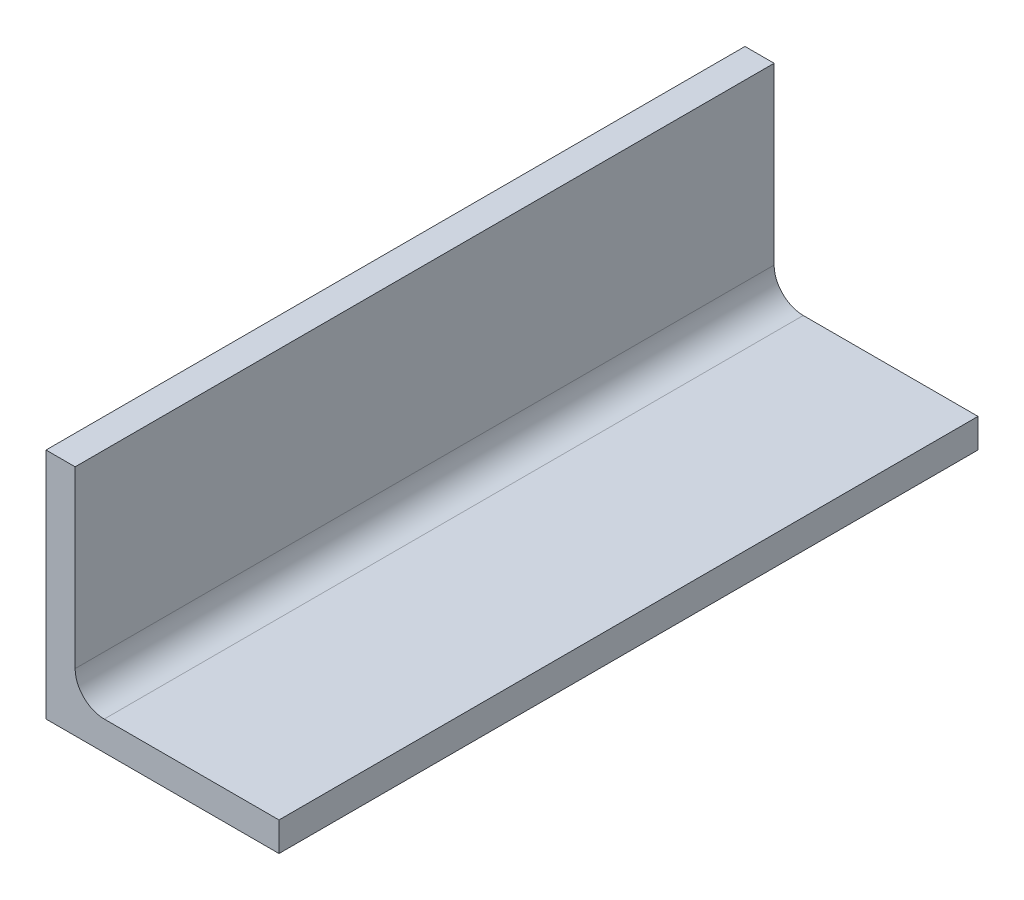
ISO-10303-21;
HEADER;
FILE_DESCRIPTION(('STEP AP214'),'2;1');
FILE_NAME('part.step','',(''),(''),'','','');
FILE_SCHEMA(('AUTOMOTIVE_DESIGN { 1 0 10303 214 1 1 1 1 }'));
ENDSEC;
DATA;
#1=APPLICATION_CONTEXT('core data for automotive mechanical design processes');
#2=APPLICATION_PROTOCOL_DEFINITION('international standard','automotive_design',2000,#1);
#3=PRODUCT_CONTEXT('',#1,'mechanical');
#4=PRODUCT('Part','Part','',(#3));
#5=PRODUCT_RELATED_PRODUCT_CATEGORY('part','',(#4));
#6=PRODUCT_DEFINITION_FORMATION('','',#4);
#7=PRODUCT_DEFINITION_CONTEXT('part definition',#1,'design');
#8=PRODUCT_DEFINITION('design','',#6,#7);
#9=PRODUCT_DEFINITION_SHAPE('','',#8);
#10=(LENGTH_UNIT() NAMED_UNIT(*) SI_UNIT(.MILLI.,.METRE.));
#11=(NAMED_UNIT(*) PLANE_ANGLE_UNIT() SI_UNIT($,.RADIAN.));
#12=(NAMED_UNIT(*) SI_UNIT($,.STERADIAN.) SOLID_ANGLE_UNIT());
#13=UNCERTAINTY_MEASURE_WITH_UNIT(LENGTH_MEASURE(1.E-05),#10,'distance_accuracy_value','');
#14=(GEOMETRIC_REPRESENTATION_CONTEXT(3) GLOBAL_UNCERTAINTY_ASSIGNED_CONTEXT((#13)) GLOBAL_UNIT_ASSIGNED_CONTEXT((#10,
#11,#12)) REPRESENTATION_CONTEXT('',''));
#15=CARTESIAN_POINT('',(0.,0.,0.));
#16=DIRECTION('',(0.,0.,1.));
#17=DIRECTION('',(1.,0.,0.));
#18=AXIS2_PLACEMENT_3D('',#15,#16,#17);
#19=CARTESIAN_POINT('',(50.8,0.,76.2));
#20=DIRECTION('',(0.,1.,0.));
#21=DIRECTION('',(-1.,0.,0.));
#22=AXIS2_PLACEMENT_3D('',#19,#20,#21);
#23=PLANE('',#22);
#24=DIRECTION('',(1.,0.,0.));
#25=VECTOR('',#24,1.);
#26=CARTESIAN_POINT('',(50.8,0.,-76.2));
#27=LINE('',#26,#25);
#28=CARTESIAN_POINT('',(0.,0.,-76.2));
#29=VERTEX_POINT('',#28);
#30=CARTESIAN_POINT('',(50.8,0.,-76.2));
#31=VERTEX_POINT('',#30);
#32=EDGE_CURVE('E107',#29,#31,#27,.T.);
#33=ORIENTED_EDGE('',*,*,#32,.T.);
#34=DIRECTION('',(0.,0.,-1.));
#35=VECTOR('',#34,1.);
#36=CARTESIAN_POINT('',(50.8,0.,76.2));
#37=LINE('',#36,#35);
#38=CARTESIAN_POINT('',(50.8,0.,76.2));
#39=VERTEX_POINT('',#38);
#40=EDGE_CURVE('E11',#39,#31,#37,.T.);
#41=ORIENTED_EDGE('',*,*,#40,.F.);
#42=DIRECTION('',(1.,0.,0.));
#43=VECTOR('',#42,1.);
#44=CARTESIAN_POINT('',(50.8,0.,76.2));
#45=LINE('',#44,#43);
#46=CARTESIAN_POINT('',(0.,0.,76.2));
#47=VERTEX_POINT('',#46);
#48=EDGE_CURVE('E119',#47,#39,#45,.T.);
#49=ORIENTED_EDGE('',*,*,#48,.F.);
#50=DIRECTION('',(0.,0.,-1.));
#51=VECTOR('',#50,1.);
#52=CARTESIAN_POINT('',(0.,0.,76.2));
#53=LINE('',#52,#51);
#54=EDGE_CURVE('E103',#47,#29,#53,.T.);
#55=ORIENTED_EDGE('',*,*,#54,.T.);
#56=EDGE_LOOP('',(#33,#41,#49,#55));
#57=FACE_BOUND('',#56,.T.);
#58=ADVANCED_FACE('F17',(#57),#23,.F.);
#59=CARTESIAN_POINT('',(50.8,6.35,76.2));
#60=DIRECTION('',(-1.,0.,0.));
#61=DIRECTION('',(0.,0.,1.));
#62=AXIS2_PLACEMENT_3D('',#59,#60,#61);
#63=PLANE('',#62);
#64=DIRECTION('',(0.,1.,0.));
#65=VECTOR('',#64,1.);
#66=CARTESIAN_POINT('',(50.8,6.35,-76.2));
#67=LINE('',#66,#65);
#68=CARTESIAN_POINT('',(50.8,6.35,-76.2));
#69=VERTEX_POINT('',#68);
#70=EDGE_CURVE('E110',#31,#69,#67,.T.);
#71=ORIENTED_EDGE('',*,*,#70,.T.);
#72=DIRECTION('',(0.,0.,-1.));
#73=VECTOR('',#72,1.);
#74=CARTESIAN_POINT('',(50.8,6.35,76.2));
#75=LINE('',#74,#73);
#76=CARTESIAN_POINT('',(50.8,6.35,76.2));
#77=VERTEX_POINT('',#76);
#78=EDGE_CURVE('E25',#77,#69,#75,.T.);
#79=ORIENTED_EDGE('',*,*,#78,.F.);
#80=DIRECTION('',(0.,1.,0.));
#81=VECTOR('',#80,1.);
#82=CARTESIAN_POINT('',(50.8,6.35,76.2));
#83=LINE('',#82,#81);
#84=EDGE_CURVE('E73',#39,#77,#83,.T.);
#85=ORIENTED_EDGE('',*,*,#84,.F.);
#86=ORIENTED_EDGE('',*,*,#40,.T.);
#87=EDGE_LOOP('',(#71,#79,#85,#86));
#88=FACE_BOUND('',#87,.T.);
#89=ADVANCED_FACE('F144',(#88),#63,.F.);
#90=CARTESIAN_POINT('',(12.7,6.35,76.2));
#91=DIRECTION('',(0.,-1.,0.));
#92=DIRECTION('',(0.,0.,-1.));
#93=AXIS2_PLACEMENT_3D('',#90,#91,#92);
#94=PLANE('',#93);
#95=DIRECTION('',(-1.,0.,0.));
#96=VECTOR('',#95,1.);
#97=CARTESIAN_POINT('',(12.7,6.35,-76.2));
#98=LINE('',#97,#96);
#99=CARTESIAN_POINT('',(12.7,6.35,-76.2));
#100=VERTEX_POINT('',#99);
#101=EDGE_CURVE('E112',#69,#100,#98,.T.);
#102=ORIENTED_EDGE('',*,*,#101,.T.);
#103=DIRECTION('',(0.,0.,-1.));
#104=VECTOR('',#103,1.);
#105=CARTESIAN_POINT('',(12.7,6.35,76.2));
#106=LINE('',#105,#104);
#107=CARTESIAN_POINT('',(12.7,6.35,76.2));
#108=VERTEX_POINT('',#107);
#109=EDGE_CURVE('E123',#108,#100,#106,.T.);
#110=ORIENTED_EDGE('',*,*,#109,.F.);
#111=DIRECTION('',(-1.,0.,0.));
#112=VECTOR('',#111,1.);
#113=CARTESIAN_POINT('',(12.7,6.35,76.2));
#114=LINE('',#113,#112);
#115=EDGE_CURVE('E131',#77,#108,#114,.T.);
#116=ORIENTED_EDGE('',*,*,#115,.F.);
#117=ORIENTED_EDGE('',*,*,#78,.T.);
#118=EDGE_LOOP('',(#102,#110,#116,#117));
#119=FACE_BOUND('',#118,.T.);
#120=ADVANCED_FACE('F129',(#119),#94,.F.);
#121=CARTESIAN_POINT('',(12.7,12.7,76.2));
#122=DIRECTION('',(0.,0.,-1.));
#123=DIRECTION('',(-1.,0.,0.));
#124=AXIS2_PLACEMENT_3D('',#121,#122,#123);
#125=CYLINDRICAL_SURFACE('',#124,6.35);
#126=CARTESIAN_POINT('',(12.7,12.7,-76.2));
#127=DIRECTION('',(0.,0.,-1.));
#128=DIRECTION('',(-1.,0.,0.));
#129=AXIS2_PLACEMENT_3D('',#126,#127,#128);
#130=CIRCLE('',#129,6.35);
#131=CARTESIAN_POINT('',(6.35,12.7,-76.2));
#132=VERTEX_POINT('',#131);
#133=EDGE_CURVE('E114',#100,#132,#130,.T.);
#134=ORIENTED_EDGE('',*,*,#133,.T.);
#135=DIRECTION('',(0.,0.,-1.));
#136=VECTOR('',#135,1.);
#137=CARTESIAN_POINT('',(6.35,12.7,76.2));
#138=LINE('',#137,#136);
#139=CARTESIAN_POINT('',(6.35,12.7,76.2));
#140=VERTEX_POINT('',#139);
#141=EDGE_CURVE('E98',#140,#132,#138,.T.);
#142=ORIENTED_EDGE('',*,*,#141,.F.);
#143=CARTESIAN_POINT('',(12.7,12.7,76.2));
#144=DIRECTION('',(0.,0.,-1.));
#145=DIRECTION('',(-1.,0.,0.));
#146=AXIS2_PLACEMENT_3D('',#143,#144,#145);
#147=CIRCLE('',#146,6.35);
#148=EDGE_CURVE('E89',#108,#140,#147,.T.);
#149=ORIENTED_EDGE('',*,*,#148,.F.);
#150=ORIENTED_EDGE('',*,*,#109,.T.);
#151=EDGE_LOOP('',(#134,#142,#149,#150));
#152=FACE_BOUND('',#151,.T.);
#153=ADVANCED_FACE('F137',(#152),#125,.F.);
#154=CARTESIAN_POINT('',(6.35,50.8,76.2));
#155=DIRECTION('',(-1.,0.,0.));
#156=DIRECTION('',(0.,-1.,0.));
#157=AXIS2_PLACEMENT_3D('',#154,#155,#156);
#158=PLANE('',#157);
#159=DIRECTION('',(0.,1.,0.));
#160=VECTOR('',#159,1.);
#161=CARTESIAN_POINT('',(6.35,50.8,-76.2));
#162=LINE('',#161,#160);
#163=CARTESIAN_POINT('',(6.35,50.8,-76.2));
#164=VERTEX_POINT('',#163);
#165=EDGE_CURVE('E97',#132,#164,#162,.T.);
#166=ORIENTED_EDGE('',*,*,#165,.T.);
#167=DIRECTION('',(0.,0.,-1.));
#168=VECTOR('',#167,1.);
#169=CARTESIAN_POINT('',(6.35,50.8,76.2));
#170=LINE('',#169,#168);
#171=CARTESIAN_POINT('',(6.35,50.8,76.2));
#172=VERTEX_POINT('',#171);
#173=EDGE_CURVE('E94',#172,#164,#170,.T.);
#174=ORIENTED_EDGE('',*,*,#173,.F.);
#175=DIRECTION('',(0.,1.,0.));
#176=VECTOR('',#175,1.);
#177=CARTESIAN_POINT('',(6.35,50.8,76.2));
#178=LINE('',#177,#176);
#179=EDGE_CURVE('E83',#140,#172,#178,.T.);
#180=ORIENTED_EDGE('',*,*,#179,.F.);
#181=ORIENTED_EDGE('',*,*,#141,.T.);
#182=EDGE_LOOP('',(#166,#174,#180,#181));
#183=FACE_BOUND('',#182,.T.);
#184=ADVANCED_FACE('F95',(#183),#158,.F.);
#185=CARTESIAN_POINT('',(0.,50.8,76.2));
#186=DIRECTION('',(0.,-1.,0.));
#187=DIRECTION('',(0.,0.,-1.));
#188=AXIS2_PLACEMENT_3D('',#185,#186,#187);
#189=PLANE('',#188);
#190=DIRECTION('',(-1.,0.,0.));
#191=VECTOR('',#190,1.);
#192=CARTESIAN_POINT('',(0.,50.8,-76.2));
#193=LINE('',#192,#191);
#194=CARTESIAN_POINT('',(0.,50.8,-76.2));
#195=VERTEX_POINT('',#194);
#196=EDGE_CURVE('E59',#164,#195,#193,.T.);
#197=ORIENTED_EDGE('',*,*,#196,.T.);
#198=DIRECTION('',(0.,0.,-1.));
#199=VECTOR('',#198,1.);
#200=CARTESIAN_POINT('',(0.,50.8,76.2));
#201=LINE('',#200,#199);
#202=CARTESIAN_POINT('',(0.,50.8,76.2));
#203=VERTEX_POINT('',#202);
#204=EDGE_CURVE('E99',#203,#195,#201,.T.);
#205=ORIENTED_EDGE('',*,*,#204,.F.);
#206=DIRECTION('',(-1.,0.,0.));
#207=VECTOR('',#206,1.);
#208=CARTESIAN_POINT('',(0.,50.8,76.2));
#209=LINE('',#208,#207);
#210=EDGE_CURVE('E87',#172,#203,#209,.T.);
#211=ORIENTED_EDGE('',*,*,#210,.F.);
#212=ORIENTED_EDGE('',*,*,#173,.T.);
#213=EDGE_LOOP('',(#197,#205,#211,#212));
#214=FACE_BOUND('',#213,.T.);
#215=ADVANCED_FACE('F101',(#214),#189,.F.);
#216=CARTESIAN_POINT('',(0.,0.,76.2));
#217=DIRECTION('',(1.,0.,0.));
#218=DIRECTION('',(0.,0.,-1.));
#219=AXIS2_PLACEMENT_3D('',#216,#217,#218);
#220=PLANE('',#219);
#221=DIRECTION('',(0.,-1.,0.));
#222=VECTOR('',#221,1.);
#223=CARTESIAN_POINT('',(0.,0.,-76.2));
#224=LINE('',#223,#222);
#225=EDGE_CURVE('E65',#195,#29,#224,.T.);
#226=ORIENTED_EDGE('',*,*,#225,.T.);
#227=ORIENTED_EDGE('',*,*,#54,.F.);
#228=DIRECTION('',(0.,-1.,0.));
#229=VECTOR('',#228,1.);
#230=CARTESIAN_POINT('',(0.,0.,76.2));
#231=LINE('',#230,#229);
#232=EDGE_CURVE('E33',#203,#47,#231,.T.);
#233=ORIENTED_EDGE('',*,*,#232,.F.);
#234=ORIENTED_EDGE('',*,*,#204,.T.);
#235=EDGE_LOOP('',(#226,#227,#233,#234));
#236=FACE_BOUND('',#235,.T.);
#237=ADVANCED_FACE('F160',(#236),#220,.F.);
#238=CARTESIAN_POINT('',(12.7,12.7,76.2));
#239=DIRECTION('',(0.,0.,-1.));
#240=DIRECTION('',(-1.,0.,0.));
#241=AXIS2_PLACEMENT_3D('',#238,#239,#240);
#242=PLANE('',#241);
#243=ORIENTED_EDGE('',*,*,#48,.T.);
#244=ORIENTED_EDGE('',*,*,#84,.T.);
#245=ORIENTED_EDGE('',*,*,#115,.T.);
#246=ORIENTED_EDGE('',*,*,#148,.T.);
#247=ORIENTED_EDGE('',*,*,#179,.T.);
#248=ORIENTED_EDGE('',*,*,#210,.T.);
#249=ORIENTED_EDGE('',*,*,#232,.T.);
#250=EDGE_LOOP('',(#243,#244,#245,#246,#247,#248,#249));
#251=FACE_BOUND('',#250,.T.);
#252=ADVANCED_FACE('F85',(#251),#242,.F.);
#253=CARTESIAN_POINT('',(12.7,12.7,-76.2));
#254=DIRECTION('',(0.,0.,-1.));
#255=DIRECTION('',(-1.,0.,0.));
#256=AXIS2_PLACEMENT_3D('',#253,#254,#255);
#257=PLANE('',#256);
#258=ORIENTED_EDGE('',*,*,#32,.F.);
#259=ORIENTED_EDGE('',*,*,#225,.F.);
#260=ORIENTED_EDGE('',*,*,#196,.F.);
#261=ORIENTED_EDGE('',*,*,#165,.F.);
#262=ORIENTED_EDGE('',*,*,#133,.F.);
#263=ORIENTED_EDGE('',*,*,#101,.F.);
#264=ORIENTED_EDGE('',*,*,#70,.F.);
#265=EDGE_LOOP('',(#258,#259,#260,#261,#262,#263,#264));
#266=FACE_BOUND('',#265,.T.);
#267=ADVANCED_FACE('F135',(#266),#257,.T.);
#268=CLOSED_SHELL('',(#58,#89,#120,#153,#184,#215,#237,#252,#267));
#269=MANIFOLD_SOLID_BREP('B1',#268);
#270=ADVANCED_BREP_SHAPE_REPRESENTATION('',(#18,#269),#14);
#271=SHAPE_DEFINITION_REPRESENTATION(#9,#270);
ENDSEC;
END-ISO-10303-21;
